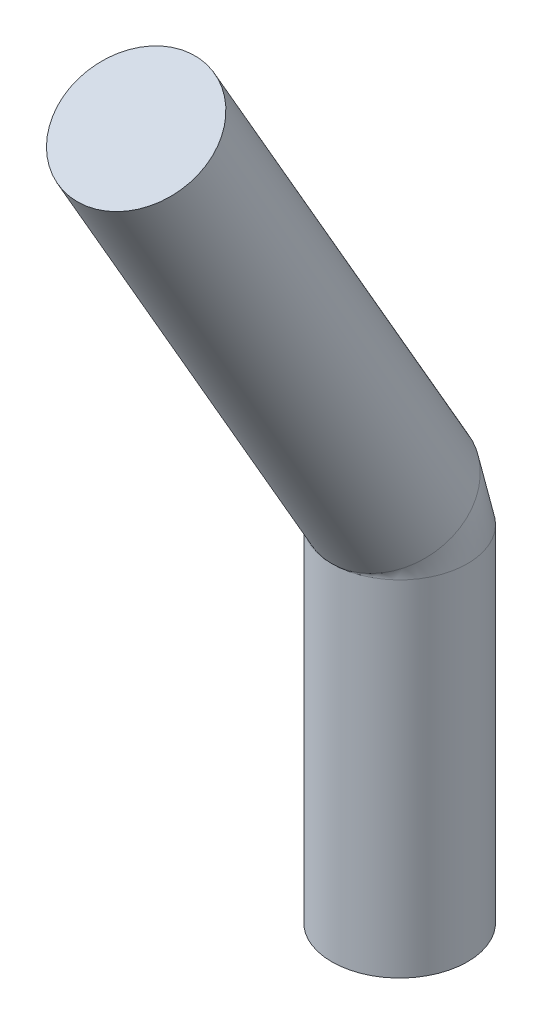
ISO-10303-21;
HEADER;
FILE_DESCRIPTION(('STEP AP214'),'2;1');
FILE_NAME('part.step','',(''),(''),'','','');
FILE_SCHEMA(('AUTOMOTIVE_DESIGN { 1 0 10303 214 1 1 1 1 }'));
ENDSEC;
DATA;
#1=APPLICATION_CONTEXT('core data for automotive mechanical design processes');
#2=APPLICATION_PROTOCOL_DEFINITION('international standard','automotive_design',2000,#1);
#3=PRODUCT_CONTEXT('',#1,'mechanical');
#4=PRODUCT('Part','Part','',(#3));
#5=PRODUCT_RELATED_PRODUCT_CATEGORY('part','',(#4));
#6=PRODUCT_DEFINITION_FORMATION('','',#4);
#7=PRODUCT_DEFINITION_CONTEXT('part definition',#1,'design');
#8=PRODUCT_DEFINITION('design','',#6,#7);
#9=PRODUCT_DEFINITION_SHAPE('','',#8);
#10=(LENGTH_UNIT() NAMED_UNIT(*) SI_UNIT(.MILLI.,.METRE.));
#11=(NAMED_UNIT(*) PLANE_ANGLE_UNIT() SI_UNIT($,.RADIAN.));
#12=(NAMED_UNIT(*) SI_UNIT($,.STERADIAN.) SOLID_ANGLE_UNIT());
#13=UNCERTAINTY_MEASURE_WITH_UNIT(LENGTH_MEASURE(1.E-05),#10,'distance_accuracy_value','');
#14=(GEOMETRIC_REPRESENTATION_CONTEXT(3) GLOBAL_UNCERTAINTY_ASSIGNED_CONTEXT((#13)) GLOBAL_UNIT_ASSIGNED_CONTEXT((#10,
#11,#12)) REPRESENTATION_CONTEXT('',''));
#15=CARTESIAN_POINT('',(0.,0.,0.));
#16=DIRECTION('',(0.,0.,1.));
#17=DIRECTION('',(1.,0.,0.));
#18=AXIS2_PLACEMENT_3D('',#15,#16,#17);
#19=CARTESIAN_POINT('',(0.,4.69711431702997,2.33038475772934));
#20=DIRECTION('',(0.,0.866025403784438,0.500000000000001));
#21=DIRECTION('',(0.,-0.500000000000001,0.866025403784438));
#22=AXIS2_PLACEMENT_3D('',#19,#20,#21);
#23=PLANE('',#22);
#24=CARTESIAN_POINT('',(0.,4.69711431702997,2.33038475772934));
#25=DIRECTION('',(0.,0.866025403784438,0.500000000000001));
#26=DIRECTION('',(0.,-0.500000000000001,0.866025403784438));
#27=AXIS2_PLACEMENT_3D('',#24,#25,#26);
#28=CIRCLE('',#27,0.6);
#29=CARTESIAN_POINT('',(0.,4.39711431702997,2.85000000000001));
#30=VERTEX_POINT('',#29);
#31=EDGE_CURVE('E11',#30,#30,#28,.T.);
#32=ORIENTED_EDGE('',*,*,#31,.T.);
#33=EDGE_LOOP('',(#32));
#34=FACE_BOUND('',#33,.T.);
#35=ADVANCED_FACE('F39',(#34),#23,.T.);
#36=CARTESIAN_POINT('',(0.,0.,0.));
#37=DIRECTION('',(0.,1.,0.));
#38=DIRECTION('',(0.,0.,1.));
#39=AXIS2_PLACEMENT_3D('',#36,#37,#38);
#40=CYLINDRICAL_SURFACE('',#39,0.6);
#41=CARTESIAN_POINT('',(0.,0.5,0.));
#42=DIRECTION('',(0.,1.,0.));
#43=DIRECTION('',(0.,0.,1.));
#44=AXIS2_PLACEMENT_3D('',#41,#42,#43);
#45=CIRCLE('',#44,0.6);
#46=CARTESIAN_POINT('',(0.,0.5,0.6));
#47=VERTEX_POINT('',#46);
#48=EDGE_CURVE('E50',#47,#47,#45,.T.);
#49=ORIENTED_EDGE('',*,*,#48,.F.);
#50=EDGE_LOOP('',(#49));
#51=FACE_BOUND('',#50,.T.);
#52=CARTESIAN_POINT('',(0.,-2.55,0.));
#53=DIRECTION('',(0.,-1.,0.));
#54=DIRECTION('',(0.,0.,-1.));
#55=AXIS2_PLACEMENT_3D('',#52,#53,#54);
#56=CIRCLE('',#55,0.6);
#57=CARTESIAN_POINT('',(0.,-2.55,-0.6));
#58=VERTEX_POINT('',#57);
#59=EDGE_CURVE('E57',#58,#58,#56,.T.);
#60=ORIENTED_EDGE('',*,*,#59,.F.);
#61=EDGE_LOOP('',(#60));
#62=FACE_BOUND('',#61,.T.);
#63=ADVANCED_FACE('F51',(#51,#62),#40,.T.);
#64=CARTESIAN_POINT('',(0.,0.5,0.6));
#65=DIRECTION('',(1.,0.,0.));
#66=DIRECTION('',(0.,0.,-1.));
#67=AXIS2_PLACEMENT_3D('',#64,#65,#66);
#68=DEGENERATE_TOROIDAL_SURFACE('',#67,0.6,0.6,.T.);
#69=CARTESIAN_POINT('',(0.,0.800000000000001,0.0803847577293372));
#70=DIRECTION('',(0.,0.866025403784438,0.500000000000001));
#71=DIRECTION('',(0.,-0.500000000000001,0.866025403784438));
#72=AXIS2_PLACEMENT_3D('',#69,#70,#71);
#73=CIRCLE('',#72,0.6);
#74=EDGE_CURVE('E46',#47,#47,#73,.T.);
#75=ORIENTED_EDGE('',*,*,#74,.F.);
#76=ORIENTED_EDGE('',*,*,#48,.T.);
#77=EDGE_LOOP('',(#75,#76));
#78=FACE_BOUND('',#77,.T.);
#79=ADVANCED_FACE('F67',(#78),#68,.T.);
#80=CARTESIAN_POINT('',(0.,0.800000000000001,0.0803847577293372));
#81=DIRECTION('',(0.,0.866025403784438,0.500000000000001));
#82=DIRECTION('',(0.,-0.500000000000001,0.866025403784438));
#83=AXIS2_PLACEMENT_3D('',#80,#81,#82);
#84=CYLINDRICAL_SURFACE('',#83,0.6);
#85=ORIENTED_EDGE('',*,*,#31,.F.);
#86=EDGE_LOOP('',(#85));
#87=FACE_BOUND('',#86,.T.);
#88=ORIENTED_EDGE('',*,*,#74,.T.);
#89=EDGE_LOOP('',(#88));
#90=FACE_BOUND('',#89,.T.);
#91=ADVANCED_FACE('F73',(#87,#90),#84,.T.);
#92=CARTESIAN_POINT('',(0.,-2.55,0.));
#93=DIRECTION('',(0.,-1.,0.));
#94=DIRECTION('',(0.,0.,-1.));
#95=AXIS2_PLACEMENT_3D('',#92,#93,#94);
#96=PLANE('',#95);
#97=ORIENTED_EDGE('',*,*,#59,.T.);
#98=EDGE_LOOP('',(#97));
#99=FACE_BOUND('',#98,.T.);
#100=ADVANCED_FACE('F65',(#99),#96,.T.);
#101=CLOSED_SHELL('',(#35,#63,#79,#91,#100));
#102=MANIFOLD_SOLID_BREP('B2',#101);
#103=ADVANCED_BREP_SHAPE_REPRESENTATION('',(#18,#102),#14);
#104=SHAPE_DEFINITION_REPRESENTATION(#9,#103);
ENDSEC;
END-ISO-10303-21;
